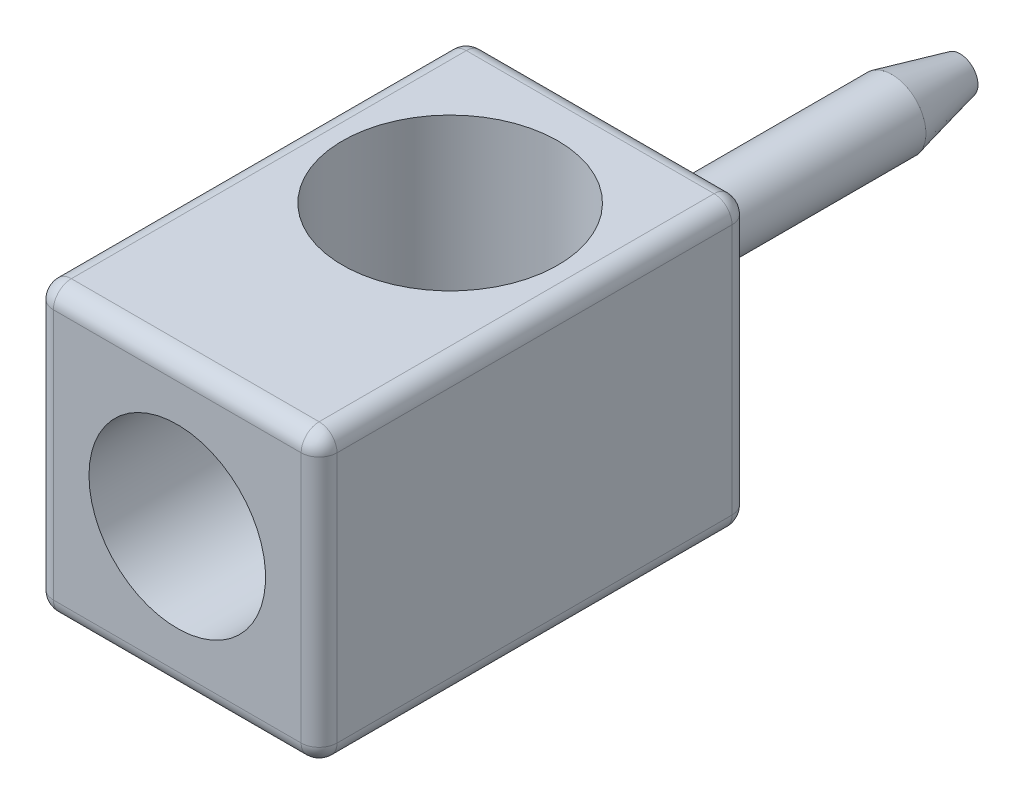
ISO-10303-21;
HEADER;
FILE_DESCRIPTION(('STEP AP214'),'2;1');
FILE_NAME('part.step','',(''),(''),'','','');
FILE_SCHEMA(('AUTOMOTIVE_DESIGN { 1 0 10303 214 1 1 1 1 }'));
ENDSEC;
DATA;
#1=APPLICATION_CONTEXT('core data for automotive mechanical design processes');
#2=APPLICATION_PROTOCOL_DEFINITION('international standard','automotive_design',2000,#1);
#3=PRODUCT_CONTEXT('',#1,'mechanical');
#4=PRODUCT('Part','Part','',(#3));
#5=PRODUCT_RELATED_PRODUCT_CATEGORY('part','',(#4));
#6=PRODUCT_DEFINITION_FORMATION('','',#4);
#7=PRODUCT_DEFINITION_CONTEXT('part definition',#1,'design');
#8=PRODUCT_DEFINITION('design','',#6,#7);
#9=PRODUCT_DEFINITION_SHAPE('','',#8);
#10=(LENGTH_UNIT() NAMED_UNIT(*) SI_UNIT(.MILLI.,.METRE.));
#11=(NAMED_UNIT(*) PLANE_ANGLE_UNIT() SI_UNIT($,.RADIAN.));
#12=(NAMED_UNIT(*) SI_UNIT($,.STERADIAN.) SOLID_ANGLE_UNIT());
#13=UNCERTAINTY_MEASURE_WITH_UNIT(LENGTH_MEASURE(1.E-05),#10,'distance_accuracy_value','');
#14=(GEOMETRIC_REPRESENTATION_CONTEXT(3) GLOBAL_UNCERTAINTY_ASSIGNED_CONTEXT((#13)) GLOBAL_UNIT_ASSIGNED_CONTEXT((#10,
#11,#12)) REPRESENTATION_CONTEXT('',''));
#15=CARTESIAN_POINT('',(0.,0.,0.));
#16=DIRECTION('',(0.,0.,1.));
#17=DIRECTION('',(1.,0.,0.));
#18=AXIS2_PLACEMENT_3D('',#15,#16,#17);
#19=CARTESIAN_POINT('',(0.,0.,-7.9));
#20=DIRECTION('',(0.,0.,1.));
#21=DIRECTION('',(1.,0.,0.));
#22=AXIS2_PLACEMENT_3D('',#19,#20,#21);
#23=PLANE('',#22);
#24=CARTESIAN_POINT('',(0.,0.,-7.90000000000646));
#25=DIRECTION('',(0.,0.,1.));
#26=DIRECTION('',(1.,0.,0.));
#27=AXIS2_PLACEMENT_3D('',#24,#25,#26);
#28=CIRCLE('',#27,0.249999999979877);
#29=CARTESIAN_POINT('',(0.249999999979877,0.,-7.90000000000646));
#30=VERTEX_POINT('',#29);
#31=EDGE_CURVE('E20',#30,#30,#28,.T.);
#32=ORIENTED_EDGE('',*,*,#31,.F.);
#33=EDGE_LOOP('',(#32));
#34=FACE_BOUND('',#33,.T.);
#35=ADVANCED_FACE('F17',(#34),#23,.F.);
#36=CARTESIAN_POINT('',(0.,0.,-6.94999999996071));
#37=DIRECTION('',(0.,0.,1.));
#38=DIRECTION('',(1.,0.,0.));
#39=AXIS2_PLACEMENT_3D('',#36,#37,#38);
#40=CONICAL_SURFACE('',#39,0.474999999994452,0.232556941808636);
#41=CARTESIAN_POINT('',(0.,0.,-6.95));
#42=DIRECTION('',(0.,0.,-1.));
#43=DIRECTION('',(-1.,0.,0.));
#44=AXIS2_PLACEMENT_3D('',#41,#42,#43);
#45=CIRCLE('',#44,0.475);
#46=CARTESIAN_POINT('',(-0.475000000000001,0.,-6.95));
#47=VERTEX_POINT('',#46);
#48=EDGE_CURVE('E217',#47,#47,#45,.F.);
#49=ORIENTED_EDGE('',*,*,#48,.F.);
#50=EDGE_LOOP('',(#49));
#51=FACE_BOUND('',#50,.T.);
#52=ORIENTED_EDGE('',*,*,#31,.T.);
#53=EDGE_LOOP('',(#52));
#54=FACE_BOUND('',#53,.T.);
#55=ADVANCED_FACE('F235',(#51,#54),#40,.T.);
#56=CARTESIAN_POINT('',(0.,0.,-7.9));
#57=DIRECTION('',(0.,0.,-1.));
#58=DIRECTION('',(-1.,0.,0.));
#59=AXIS2_PLACEMENT_3D('',#56,#57,#58);
#60=CYLINDRICAL_SURFACE('',#59,0.475);
#61=CARTESIAN_POINT('',(0.,0.,-3.));
#62=DIRECTION('',(0.,0.,-1.));
#63=DIRECTION('',(-1.,0.,0.));
#64=AXIS2_PLACEMENT_3D('',#61,#62,#63);
#65=CIRCLE('',#64,0.475);
#66=CARTESIAN_POINT('',(-0.475000000000001,0.,-3.));
#67=VERTEX_POINT('',#66);
#68=EDGE_CURVE('E195',#67,#67,#65,.T.);
#69=ORIENTED_EDGE('',*,*,#68,.T.);
#70=EDGE_LOOP('',(#69));
#71=FACE_BOUND('',#70,.T.);
#72=ORIENTED_EDGE('',*,*,#48,.T.);
#73=EDGE_LOOP('',(#72));
#74=FACE_BOUND('',#73,.T.);
#75=ADVANCED_FACE('F232',(#71,#74),#60,.T.);
#76=CARTESIAN_POINT('',(1.725,-2.,-2.75));
#77=DIRECTION('',(0.,-1.,0.));
#78=DIRECTION('',(0.,0.,-1.));
#79=AXIS2_PLACEMENT_3D('',#76,#77,#78);
#80=CYLINDRICAL_SURFACE('',#79,0.25);
#81=CARTESIAN_POINT('',(1.725,1.75,-2.75));
#82=DIRECTION('',(0.,1.,-6.13305568504924E-12));
#83=DIRECTION('',(1.,0.,0.));
#84=AXIS2_PLACEMENT_3D('',#81,#82,#83);
#85=CIRCLE('',#84,0.25);
#86=CARTESIAN_POINT('',(1.975,1.75,-2.75));
#87=VERTEX_POINT('',#86);
#88=CARTESIAN_POINT('',(1.725,1.74999999999962,-3.));
#89=VERTEX_POINT('',#88);
#90=EDGE_CURVE('E216',#87,#89,#85,.T.);
#91=ORIENTED_EDGE('',*,*,#90,.F.);
#92=DIRECTION('',(0.,1.,0.));
#93=VECTOR('',#92,1.);
#94=CARTESIAN_POINT('',(1.975,-2.,-2.75));
#95=LINE('',#94,#93);
#96=CARTESIAN_POINT('',(1.975,-1.75,-2.75));
#97=VERTEX_POINT('',#96);
#98=EDGE_CURVE('E105',#87,#97,#95,.F.);
#99=ORIENTED_EDGE('',*,*,#98,.T.);
#100=CARTESIAN_POINT('',(1.725,-1.75,-2.75));
#101=DIRECTION('',(0.,1.,0.));
#102=DIRECTION('',(1.,0.,0.));
#103=AXIS2_PLACEMENT_3D('',#100,#101,#102);
#104=CIRCLE('',#103,0.25);
#105=CARTESIAN_POINT('',(1.725,-1.75,-3.));
#106=VERTEX_POINT('',#105);
#107=EDGE_CURVE('E193',#106,#97,#104,.F.);
#108=ORIENTED_EDGE('',*,*,#107,.F.);
#109=DIRECTION('',(0.,1.,0.));
#110=VECTOR('',#109,1.);
#111=CARTESIAN_POINT('',(1.725,-2.,-3.));
#112=LINE('',#111,#110);
#113=EDGE_CURVE('E192',#106,#89,#112,.T.);
#114=ORIENTED_EDGE('',*,*,#113,.T.);
#115=EDGE_LOOP('',(#91,#99,#108,#114));
#116=FACE_BOUND('',#115,.T.);
#117=ADVANCED_FACE('F228',(#116),#80,.T.);
#118=CARTESIAN_POINT('',(-1.725,2.,-2.75));
#119=DIRECTION('',(0.,1.,0.));
#120=DIRECTION('',(0.,0.,1.));
#121=AXIS2_PLACEMENT_3D('',#118,#119,#120);
#122=CYLINDRICAL_SURFACE('',#121,0.25);
#123=CARTESIAN_POINT('',(-1.725,1.75,-2.75));
#124=DIRECTION('',(0.,1.,0.));
#125=DIRECTION('',(1.,0.,0.));
#126=AXIS2_PLACEMENT_3D('',#123,#124,#125);
#127=CIRCLE('',#126,0.25);
#128=CARTESIAN_POINT('',(-1.725,1.75,-3.));
#129=VERTEX_POINT('',#128);
#130=CARTESIAN_POINT('',(-1.975,1.75,-2.75));
#131=VERTEX_POINT('',#130);
#132=EDGE_CURVE('E123',#129,#131,#127,.T.);
#133=ORIENTED_EDGE('',*,*,#132,.F.);
#134=DIRECTION('',(0.,1.,0.));
#135=VECTOR('',#134,1.);
#136=CARTESIAN_POINT('',(-1.725,-2.,-3.));
#137=LINE('',#136,#135);
#138=CARTESIAN_POINT('',(-1.725,-1.75000000000038,-3.));
#139=VERTEX_POINT('',#138);
#140=EDGE_CURVE('E422',#129,#139,#137,.F.);
#141=ORIENTED_EDGE('',*,*,#140,.T.);
#142=CARTESIAN_POINT('',(-1.725,-1.75,-2.75));
#143=DIRECTION('',(0.,1.,-6.13305568504924E-12));
#144=DIRECTION('',(1.,0.,0.));
#145=AXIS2_PLACEMENT_3D('',#142,#143,#144);
#146=CIRCLE('',#145,0.25);
#147=CARTESIAN_POINT('',(-1.975,-1.75,-2.75));
#148=VERTEX_POINT('',#147);
#149=EDGE_CURVE('E171',#148,#139,#146,.F.);
#150=ORIENTED_EDGE('',*,*,#149,.F.);
#151=DIRECTION('',(0.,1.,0.));
#152=VECTOR('',#151,1.);
#153=CARTESIAN_POINT('',(-1.975,2.,-2.75));
#154=LINE('',#153,#152);
#155=EDGE_CURVE('E168',#148,#131,#154,.T.);
#156=ORIENTED_EDGE('',*,*,#155,.T.);
#157=EDGE_LOOP('',(#133,#141,#150,#156));
#158=FACE_BOUND('',#157,.T.);
#159=ADVANCED_FACE('F225',(#158),#122,.T.);
#160=CARTESIAN_POINT('',(1.725,1.75,2.75));
#161=DIRECTION('',(1.,0.,0.));
#162=DIRECTION('',(0.,1.,0.));
#163=AXIS2_PLACEMENT_3D('',#160,#161,#162);
#164=SPHERICAL_SURFACE('',#163,0.25);
#165=CARTESIAN_POINT('',(1.725,1.75,2.75));
#166=DIRECTION('',(0.,0.,1.));
#167=DIRECTION('',(1.,0.,0.));
#168=AXIS2_PLACEMENT_3D('',#165,#166,#167);
#169=CIRCLE('',#168,0.25);
#170=CARTESIAN_POINT('',(1.725,2.,2.75));
#171=VERTEX_POINT('',#170);
#172=CARTESIAN_POINT('',(1.975,1.75,2.75));
#173=VERTEX_POINT('',#172);
#174=EDGE_CURVE('E114',#171,#173,#169,.F.);
#175=ORIENTED_EDGE('',*,*,#174,.F.);
#176=CARTESIAN_POINT('',(1.725,1.75,2.75));
#177=DIRECTION('',(-1.,0.,0.));
#178=DIRECTION('',(0.,0.,1.));
#179=AXIS2_PLACEMENT_3D('',#176,#177,#178);
#180=CIRCLE('',#179,0.25);
#181=CARTESIAN_POINT('',(1.725,1.75,3.));
#182=VERTEX_POINT('',#181);
#183=EDGE_CURVE('E116',#182,#171,#180,.T.);
#184=ORIENTED_EDGE('',*,*,#183,.F.);
#185=CARTESIAN_POINT('',(1.725,1.75,2.75));
#186=DIRECTION('',(0.,1.,0.));
#187=DIRECTION('',(0.,0.,1.));
#188=AXIS2_PLACEMENT_3D('',#185,#186,#187);
#189=CIRCLE('',#188,0.25);
#190=EDGE_CURVE('E111',#173,#182,#189,.F.);
#191=ORIENTED_EDGE('',*,*,#190,.F.);
#192=EDGE_LOOP('',(#175,#184,#191));
#193=FACE_BOUND('',#192,.T.);
#194=ADVANCED_FACE('F113',(#193),#164,.T.);
#195=CARTESIAN_POINT('',(-1.725,1.75,2.75));
#196=DIRECTION('',(1.,0.,0.));
#197=DIRECTION('',(0.,1.,0.));
#198=AXIS2_PLACEMENT_3D('',#195,#196,#197);
#199=SPHERICAL_SURFACE('',#198,0.25);
#200=CARTESIAN_POINT('',(-1.725,1.75,2.75));
#201=DIRECTION('',(-1.,0.,0.));
#202=DIRECTION('',(0.,0.,1.));
#203=AXIS2_PLACEMENT_3D('',#200,#201,#202);
#204=CIRCLE('',#203,0.25);
#205=CARTESIAN_POINT('',(-1.725,2.,2.75));
#206=VERTEX_POINT('',#205);
#207=CARTESIAN_POINT('',(-1.725,1.75000000000077,3.));
#208=VERTEX_POINT('',#207);
#209=EDGE_CURVE('E313',#206,#208,#204,.F.);
#210=ORIENTED_EDGE('',*,*,#209,.F.);
#211=CARTESIAN_POINT('',(-1.725,1.75,2.75));
#212=DIRECTION('',(0.,0.,1.));
#213=DIRECTION('',(1.,0.,0.));
#214=AXIS2_PLACEMENT_3D('',#211,#212,#213);
#215=CIRCLE('',#214,0.25);
#216=CARTESIAN_POINT('',(-1.975,1.75,2.75));
#217=VERTEX_POINT('',#216);
#218=EDGE_CURVE('E321',#217,#206,#215,.F.);
#219=ORIENTED_EDGE('',*,*,#218,.F.);
#220=CARTESIAN_POINT('',(-1.725,1.75,2.75));
#221=DIRECTION('',(0.,-1.,0.));
#222=DIRECTION('',(0.,0.,-1.));
#223=AXIS2_PLACEMENT_3D('',#220,#221,#222);
#224=CIRCLE('',#223,0.25);
#225=EDGE_CURVE('E122',#208,#217,#224,.T.);
#226=ORIENTED_EDGE('',*,*,#225,.F.);
#227=EDGE_LOOP('',(#210,#219,#226));
#228=FACE_BOUND('',#227,.T.);
#229=ADVANCED_FACE('F210',(#228),#199,.T.);
#230=CARTESIAN_POINT('',(1.725,1.75,-2.75));
#231=DIRECTION('',(1.,0.,0.));
#232=DIRECTION('',(0.,1.,0.));
#233=AXIS2_PLACEMENT_3D('',#230,#231,#232);
#234=SPHERICAL_SURFACE('',#233,0.25);
#235=ORIENTED_EDGE('',*,*,#90,.T.);
#236=CARTESIAN_POINT('',(1.725,1.75,-2.75));
#237=DIRECTION('',(1.,0.,0.));
#238=DIRECTION('',(0.,0.,-1.));
#239=AXIS2_PLACEMENT_3D('',#236,#237,#238);
#240=CIRCLE('',#239,0.25);
#241=CARTESIAN_POINT('',(1.725,2.,-2.75));
#242=VERTEX_POINT('',#241);
#243=EDGE_CURVE('E345',#242,#89,#240,.F.);
#244=ORIENTED_EDGE('',*,*,#243,.F.);
#245=CARTESIAN_POINT('',(1.725,1.75,-2.75));
#246=DIRECTION('',(0.,0.,1.));
#247=DIRECTION('',(1.,0.,0.));
#248=AXIS2_PLACEMENT_3D('',#245,#246,#247);
#249=CIRCLE('',#248,0.25);
#250=EDGE_CURVE('E141',#87,#242,#249,.T.);
#251=ORIENTED_EDGE('',*,*,#250,.F.);
#252=EDGE_LOOP('',(#235,#244,#251));
#253=FACE_BOUND('',#252,.T.);
#254=ADVANCED_FACE('F206',(#253),#234,.T.);
#255=CARTESIAN_POINT('',(-1.725,1.75,-2.75));
#256=DIRECTION('',(1.,0.,0.));
#257=DIRECTION('',(0.,1.,0.));
#258=AXIS2_PLACEMENT_3D('',#255,#256,#257);
#259=SPHERICAL_SURFACE('',#258,0.25);
#260=ORIENTED_EDGE('',*,*,#132,.T.);
#261=CARTESIAN_POINT('',(-1.725,1.75,-2.75));
#262=DIRECTION('',(0.,0.,1.));
#263=DIRECTION('',(1.,0.,0.));
#264=AXIS2_PLACEMENT_3D('',#261,#262,#263);
#265=CIRCLE('',#264,0.25);
#266=CARTESIAN_POINT('',(-1.725,2.,-2.75));
#267=VERTEX_POINT('',#266);
#268=EDGE_CURVE('E351',#267,#131,#265,.T.);
#269=ORIENTED_EDGE('',*,*,#268,.F.);
#270=CARTESIAN_POINT('',(-1.725,1.75,-2.75));
#271=DIRECTION('',(1.,0.,0.));
#272=DIRECTION('',(0.,0.,-1.));
#273=AXIS2_PLACEMENT_3D('',#270,#271,#272);
#274=CIRCLE('',#273,0.25);
#275=EDGE_CURVE('E340',#129,#267,#274,.T.);
#276=ORIENTED_EDGE('',*,*,#275,.F.);
#277=EDGE_LOOP('',(#260,#269,#276));
#278=FACE_BOUND('',#277,.T.);
#279=ADVANCED_FACE('F202',(#278),#259,.T.);
#280=CARTESIAN_POINT('',(1.725,-2.,2.75));
#281=DIRECTION('',(0.,1.,0.));
#282=DIRECTION('',(0.,0.,1.));
#283=AXIS2_PLACEMENT_3D('',#280,#281,#282);
#284=CYLINDRICAL_SURFACE('',#283,0.25);
#285=ORIENTED_EDGE('',*,*,#190,.T.);
#286=DIRECTION('',(0.,1.,0.));
#287=VECTOR('',#286,1.);
#288=CARTESIAN_POINT('',(1.725,-2.,3.));
#289=LINE('',#288,#287);
#290=CARTESIAN_POINT('',(1.725,-1.74999999999962,3.));
#291=VERTEX_POINT('',#290);
#292=EDGE_CURVE('E327',#291,#182,#289,.T.);
#293=ORIENTED_EDGE('',*,*,#292,.F.);
#294=CARTESIAN_POINT('',(1.725,-1.75,2.75));
#295=DIRECTION('',(0.,-1.,6.13293322036932E-12));
#296=DIRECTION('',(1.,0.,0.));
#297=AXIS2_PLACEMENT_3D('',#294,#295,#296);
#298=CIRCLE('',#297,0.25);
#299=CARTESIAN_POINT('',(1.975,-1.75,2.75));
#300=VERTEX_POINT('',#299);
#301=EDGE_CURVE('E137',#300,#291,#298,.T.);
#302=ORIENTED_EDGE('',*,*,#301,.F.);
#303=DIRECTION('',(0.,1.,0.));
#304=VECTOR('',#303,1.);
#305=CARTESIAN_POINT('',(1.975,-2.,2.75));
#306=LINE('',#305,#304);
#307=EDGE_CURVE('E135',#300,#173,#306,.T.);
#308=ORIENTED_EDGE('',*,*,#307,.T.);
#309=EDGE_LOOP('',(#285,#293,#302,#308));
#310=FACE_BOUND('',#309,.T.);
#311=ADVANCED_FACE('F136',(#310),#284,.T.);
#312=CARTESIAN_POINT('',(-1.725,-2.,2.75));
#313=DIRECTION('',(0.,-1.,0.));
#314=DIRECTION('',(0.,0.,-1.));
#315=AXIS2_PLACEMENT_3D('',#312,#313,#314);
#316=CYLINDRICAL_SURFACE('',#315,0.25);
#317=ORIENTED_EDGE('',*,*,#225,.T.);
#318=DIRECTION('',(0.,1.,0.));
#319=VECTOR('',#318,1.);
#320=CARTESIAN_POINT('',(-1.975,2.,2.75));
#321=LINE('',#320,#319);
#322=CARTESIAN_POINT('',(-1.975,-1.75,2.75));
#323=VERTEX_POINT('',#322);
#324=EDGE_CURVE('E165',#217,#323,#321,.F.);
#325=ORIENTED_EDGE('',*,*,#324,.T.);
#326=CARTESIAN_POINT('',(-1.725,-1.75,2.75));
#327=DIRECTION('',(0.,-1.,0.));
#328=DIRECTION('',(1.,0.,0.));
#329=AXIS2_PLACEMENT_3D('',#326,#327,#328);
#330=CIRCLE('',#329,0.25);
#331=CARTESIAN_POINT('',(-1.725,-1.75,3.));
#332=VERTEX_POINT('',#331);
#333=EDGE_CURVE('E132',#332,#323,#330,.T.);
#334=ORIENTED_EDGE('',*,*,#333,.F.);
#335=DIRECTION('',(0.,1.,0.));
#336=VECTOR('',#335,1.);
#337=CARTESIAN_POINT('',(-1.725,-2.,3.));
#338=LINE('',#337,#336);
#339=EDGE_CURVE('E326',#208,#332,#338,.F.);
#340=ORIENTED_EDGE('',*,*,#339,.F.);
#341=EDGE_LOOP('',(#317,#325,#334,#340));
#342=FACE_BOUND('',#341,.T.);
#343=ADVANCED_FACE('F332',(#342),#316,.T.);
#344=CARTESIAN_POINT('',(1.975,-2.,3.));
#345=DIRECTION('',(-1.,0.,0.));
#346=DIRECTION('',(0.,0.,1.));
#347=AXIS2_PLACEMENT_3D('',#344,#345,#346);
#348=PLANE('',#347);
#349=DIRECTION('',(0.,0.,1.));
#350=VECTOR('',#349,1.);
#351=CARTESIAN_POINT('',(1.975,1.75,3.));
#352=LINE('',#351,#350);
#353=EDGE_CURVE('E128',#173,#87,#352,.F.);
#354=ORIENTED_EDGE('',*,*,#353,.F.);
#355=ORIENTED_EDGE('',*,*,#307,.F.);
#356=DIRECTION('',(0.,0.,1.));
#357=VECTOR('',#356,1.);
#358=CARTESIAN_POINT('',(1.975,-1.75,3.));
#359=LINE('',#358,#357);
#360=EDGE_CURVE('E384',#97,#300,#359,.T.);
#361=ORIENTED_EDGE('',*,*,#360,.F.);
#362=ORIENTED_EDGE('',*,*,#98,.F.);
#363=EDGE_LOOP('',(#354,#355,#361,#362));
#364=FACE_BOUND('',#363,.T.);
#365=ADVANCED_FACE('F140',(#364),#348,.F.);
#366=CARTESIAN_POINT('',(1.725,-1.75,-2.75));
#367=DIRECTION('',(1.,0.,0.));
#368=DIRECTION('',(0.,1.,0.));
#369=AXIS2_PLACEMENT_3D('',#366,#367,#368);
#370=SPHERICAL_SURFACE('',#369,0.25);
#371=CARTESIAN_POINT('',(1.725,-1.75,-2.75));
#372=DIRECTION('',(0.,0.,1.));
#373=DIRECTION('',(1.,0.,0.));
#374=AXIS2_PLACEMENT_3D('',#371,#372,#373);
#375=CIRCLE('',#374,0.25);
#376=CARTESIAN_POINT('',(1.725,-2.,-2.74999999999847));
#377=VERTEX_POINT('',#376);
#378=EDGE_CURVE('E335',#377,#97,#375,.T.);
#379=ORIENTED_EDGE('',*,*,#378,.F.);
#380=CARTESIAN_POINT('',(1.725,-1.75,-2.75));
#381=DIRECTION('',(-1.,0.,0.));
#382=DIRECTION('',(0.,0.,1.));
#383=AXIS2_PLACEMENT_3D('',#380,#381,#382);
#384=CIRCLE('',#383,0.25);
#385=EDGE_CURVE('E382',#106,#377,#384,.T.);
#386=ORIENTED_EDGE('',*,*,#385,.F.);
#387=ORIENTED_EDGE('',*,*,#107,.T.);
#388=EDGE_LOOP('',(#379,#386,#387));
#389=FACE_BOUND('',#388,.T.);
#390=ADVANCED_FACE('F182',(#389),#370,.T.);
#391=CARTESIAN_POINT('',(-1.975,-2.,-3.));
#392=DIRECTION('',(0.,0.,1.));
#393=DIRECTION('',(1.,0.,0.));
#394=AXIS2_PLACEMENT_3D('',#391,#392,#393);
#395=PLANE('',#394);
#396=DIRECTION('',(1.,0.,0.));
#397=VECTOR('',#396,1.);
#398=CARTESIAN_POINT('',(1.975,1.75,-3.));
#399=LINE('',#398,#397);
#400=EDGE_CURVE('E342',#89,#129,#399,.F.);
#401=ORIENTED_EDGE('',*,*,#400,.F.);
#402=ORIENTED_EDGE('',*,*,#113,.F.);
#403=DIRECTION('',(-1.,0.,0.));
#404=VECTOR('',#403,1.);
#405=CARTESIAN_POINT('',(-1.975,-1.75,-3.));
#406=LINE('',#405,#404);
#407=EDGE_CURVE('E376',#139,#106,#406,.F.);
#408=ORIENTED_EDGE('',*,*,#407,.F.);
#409=ORIENTED_EDGE('',*,*,#140,.F.);
#410=EDGE_LOOP('',(#401,#402,#408,#409));
#411=FACE_BOUND('',#410,.T.);
#412=ORIENTED_EDGE('',*,*,#68,.F.);
#413=EDGE_LOOP('',(#412));
#414=FACE_BOUND('',#413,.T.);
#415=ADVANCED_FACE('F178',(#411,#414),#395,.F.);
#416=CARTESIAN_POINT('',(-1.725,-1.75,-2.75));
#417=DIRECTION('',(1.,0.,0.));
#418=DIRECTION('',(0.,1.,0.));
#419=AXIS2_PLACEMENT_3D('',#416,#417,#418);
#420=SPHERICAL_SURFACE('',#419,0.25);
#421=CARTESIAN_POINT('',(-1.725,-1.75,-2.75));
#422=DIRECTION('',(0.,0.,1.));
#423=DIRECTION('',(1.,0.,0.));
#424=AXIS2_PLACEMENT_3D('',#421,#422,#423);
#425=CIRCLE('',#424,0.25);
#426=CARTESIAN_POINT('',(-1.725,-2.,-2.75));
#427=VERTEX_POINT('',#426);
#428=EDGE_CURVE('E371',#148,#427,#425,.T.);
#429=ORIENTED_EDGE('',*,*,#428,.F.);
#430=ORIENTED_EDGE('',*,*,#149,.T.);
#431=CARTESIAN_POINT('',(-1.725,-1.75,-2.75));
#432=DIRECTION('',(-1.,0.,0.));
#433=DIRECTION('',(0.,0.,1.));
#434=AXIS2_PLACEMENT_3D('',#431,#432,#433);
#435=CIRCLE('',#434,0.25);
#436=EDGE_CURVE('E379',#427,#139,#435,.F.);
#437=ORIENTED_EDGE('',*,*,#436,.F.);
#438=EDGE_LOOP('',(#429,#430,#437));
#439=FACE_BOUND('',#438,.T.);
#440=ADVANCED_FACE('F175',(#439),#420,.T.);
#441=CARTESIAN_POINT('',(-1.975,2.,3.));
#442=DIRECTION('',(1.,0.,0.));
#443=DIRECTION('',(0.,0.,-1.));
#444=AXIS2_PLACEMENT_3D('',#441,#442,#443);
#445=PLANE('',#444);
#446=DIRECTION('',(0.,0.,1.));
#447=VECTOR('',#446,1.);
#448=CARTESIAN_POINT('',(-1.975,1.75,3.));
#449=LINE('',#448,#447);
#450=EDGE_CURVE('E348',#131,#217,#449,.T.);
#451=ORIENTED_EDGE('',*,*,#450,.F.);
#452=ORIENTED_EDGE('',*,*,#155,.F.);
#453=DIRECTION('',(0.,0.,1.));
#454=VECTOR('',#453,1.);
#455=CARTESIAN_POINT('',(-1.975,-1.75,3.));
#456=LINE('',#455,#454);
#457=EDGE_CURVE('E362',#323,#148,#456,.F.);
#458=ORIENTED_EDGE('',*,*,#457,.F.);
#459=ORIENTED_EDGE('',*,*,#324,.F.);
#460=EDGE_LOOP('',(#451,#452,#458,#459));
#461=FACE_BOUND('',#460,.T.);
#462=ADVANCED_FACE('F159',(#461),#445,.F.);
#463=CARTESIAN_POINT('',(1.725,-1.75,2.75));
#464=DIRECTION('',(1.,0.,0.));
#465=DIRECTION('',(0.,1.,0.));
#466=AXIS2_PLACEMENT_3D('',#463,#464,#465);
#467=SPHERICAL_SURFACE('',#466,0.25);
#468=CARTESIAN_POINT('',(1.725,-1.75,2.75));
#469=DIRECTION('',(0.,0.,1.));
#470=DIRECTION('',(1.,0.,0.));
#471=AXIS2_PLACEMENT_3D('',#468,#469,#470);
#472=CIRCLE('',#471,0.25);
#473=CARTESIAN_POINT('',(1.725,-2.,2.75));
#474=VERTEX_POINT('',#473);
#475=EDGE_CURVE('E333',#300,#474,#472,.F.);
#476=ORIENTED_EDGE('',*,*,#475,.F.);
#477=ORIENTED_EDGE('',*,*,#301,.T.);
#478=CARTESIAN_POINT('',(1.725,-1.75,2.75));
#479=DIRECTION('',(1.,0.,0.));
#480=DIRECTION('',(0.,0.,-1.));
#481=AXIS2_PLACEMENT_3D('',#478,#479,#480);
#482=CIRCLE('',#481,0.25);
#483=EDGE_CURVE('E365',#474,#291,#482,.F.);
#484=ORIENTED_EDGE('',*,*,#483,.F.);
#485=EDGE_LOOP('',(#476,#477,#484));
#486=FACE_BOUND('',#485,.T.);
#487=ADVANCED_FACE('F154',(#486),#467,.T.);
#488=CARTESIAN_POINT('',(-1.725,-1.75,2.75));
#489=DIRECTION('',(1.,0.,0.));
#490=DIRECTION('',(0.,1.,0.));
#491=AXIS2_PLACEMENT_3D('',#488,#489,#490);
#492=SPHERICAL_SURFACE('',#491,0.25);
#493=CARTESIAN_POINT('',(-1.725,-1.75,2.75));
#494=DIRECTION('',(1.,0.,0.));
#495=DIRECTION('',(0.,0.,-1.));
#496=AXIS2_PLACEMENT_3D('',#493,#494,#495);
#497=CIRCLE('',#496,0.25);
#498=CARTESIAN_POINT('',(-1.725,-2.,2.74999999999847));
#499=VERTEX_POINT('',#498);
#500=EDGE_CURVE('E35',#332,#499,#497,.T.);
#501=ORIENTED_EDGE('',*,*,#500,.F.);
#502=ORIENTED_EDGE('',*,*,#333,.T.);
#503=CARTESIAN_POINT('',(-1.725,-1.75,2.75));
#504=DIRECTION('',(0.,0.,1.));
#505=DIRECTION('',(1.,0.,0.));
#506=AXIS2_PLACEMENT_3D('',#503,#504,#505);
#507=CIRCLE('',#506,0.25);
#508=EDGE_CURVE('E366',#499,#323,#507,.F.);
#509=ORIENTED_EDGE('',*,*,#508,.F.);
#510=EDGE_LOOP('',(#501,#502,#509));
#511=FACE_BOUND('',#510,.T.);
#512=ADVANCED_FACE('F150',(#511),#492,.T.);
#513=CARTESIAN_POINT('',(1.725,1.75,3.));
#514=DIRECTION('',(0.,0.,1.));
#515=DIRECTION('',(1.,0.,0.));
#516=AXIS2_PLACEMENT_3D('',#513,#514,#515);
#517=CYLINDRICAL_SURFACE('',#516,0.25);
#518=ORIENTED_EDGE('',*,*,#250,.T.);
#519=DIRECTION('',(0.,0.,-1.));
#520=VECTOR('',#519,1.);
#521=CARTESIAN_POINT('',(1.725,2.,3.));
#522=LINE('',#521,#520);
#523=EDGE_CURVE('E131',#242,#171,#522,.F.);
#524=ORIENTED_EDGE('',*,*,#523,.T.);
#525=ORIENTED_EDGE('',*,*,#174,.T.);
#526=ORIENTED_EDGE('',*,*,#353,.T.);
#527=EDGE_LOOP('',(#518,#524,#525,#526));
#528=FACE_BOUND('',#527,.T.);
#529=ADVANCED_FACE('F127',(#528),#517,.T.);
#530=CARTESIAN_POINT('',(-1.975,1.75,2.75));
#531=DIRECTION('',(-1.,0.,0.));
#532=DIRECTION('',(0.,0.,1.));
#533=AXIS2_PLACEMENT_3D('',#530,#531,#532);
#534=CYLINDRICAL_SURFACE('',#533,0.25);
#535=ORIENTED_EDGE('',*,*,#209,.T.);
#536=DIRECTION('',(1.,0.,0.));
#537=VECTOR('',#536,1.);
#538=CARTESIAN_POINT('',(-1.975,1.75,3.));
#539=LINE('',#538,#537);
#540=EDGE_CURVE('E315',#182,#208,#539,.F.);
#541=ORIENTED_EDGE('',*,*,#540,.F.);
#542=ORIENTED_EDGE('',*,*,#183,.T.);
#543=DIRECTION('',(1.,0.,0.));
#544=VECTOR('',#543,1.);
#545=CARTESIAN_POINT('',(1.975,2.,2.75));
#546=LINE('',#545,#544);
#547=EDGE_CURVE('E316',#171,#206,#546,.F.);
#548=ORIENTED_EDGE('',*,*,#547,.T.);
#549=EDGE_LOOP('',(#535,#541,#542,#548));
#550=FACE_BOUND('',#549,.T.);
#551=ADVANCED_FACE('F304',(#550),#534,.T.);
#552=CARTESIAN_POINT('',(-1.725,1.75,3.));
#553=DIRECTION('',(0.,0.,1.));
#554=DIRECTION('',(1.,0.,0.));
#555=AXIS2_PLACEMENT_3D('',#552,#553,#554);
#556=CYLINDRICAL_SURFACE('',#555,0.25);
#557=ORIENTED_EDGE('',*,*,#268,.T.);
#558=ORIENTED_EDGE('',*,*,#450,.T.);
#559=ORIENTED_EDGE('',*,*,#218,.T.);
#560=DIRECTION('',(0.,0.,-1.));
#561=VECTOR('',#560,1.);
#562=CARTESIAN_POINT('',(-1.725,2.,3.));
#563=LINE('',#562,#561);
#564=EDGE_CURVE('E355',#206,#267,#563,.T.);
#565=ORIENTED_EDGE('',*,*,#564,.T.);
#566=EDGE_LOOP('',(#557,#558,#559,#565));
#567=FACE_BOUND('',#566,.T.);
#568=ADVANCED_FACE('F301',(#567),#556,.T.);
#569=CARTESIAN_POINT('',(1.975,1.75,-2.75));
#570=DIRECTION('',(1.,0.,0.));
#571=DIRECTION('',(0.,0.,-1.));
#572=AXIS2_PLACEMENT_3D('',#569,#570,#571);
#573=CYLINDRICAL_SURFACE('',#572,0.25);
#574=ORIENTED_EDGE('',*,*,#275,.T.);
#575=DIRECTION('',(1.,0.,0.));
#576=VECTOR('',#575,1.);
#577=CARTESIAN_POINT('',(1.975,2.,-2.75));
#578=LINE('',#577,#576);
#579=EDGE_CURVE('E401',#267,#242,#578,.T.);
#580=ORIENTED_EDGE('',*,*,#579,.T.);
#581=ORIENTED_EDGE('',*,*,#243,.T.);
#582=ORIENTED_EDGE('',*,*,#400,.T.);
#583=EDGE_LOOP('',(#574,#580,#581,#582));
#584=FACE_BOUND('',#583,.T.);
#585=ADVANCED_FACE('F297',(#584),#573,.T.);
#586=CARTESIAN_POINT('',(-1.975,-2.,3.));
#587=DIRECTION('',(0.,0.,1.));
#588=DIRECTION('',(1.,0.,0.));
#589=AXIS2_PLACEMENT_3D('',#586,#587,#588);
#590=PLANE('',#589);
#591=CARTESIAN_POINT('',(0.,0.,3.));
#592=DIRECTION('',(0.,0.,-1.));
#593=DIRECTION('',(-1.,0.,0.));
#594=AXIS2_PLACEMENT_3D('',#591,#592,#593);
#595=CIRCLE('',#594,1.2295);
#596=CARTESIAN_POINT('',(-1.2295,0.,3.));
#597=VERTEX_POINT('',#596);
#598=EDGE_CURVE('E270',#597,#597,#595,.T.);
#599=ORIENTED_EDGE('',*,*,#598,.T.);
#600=EDGE_LOOP('',(#599));
#601=FACE_BOUND('',#600,.T.);
#602=ORIENTED_EDGE('',*,*,#339,.T.);
#603=DIRECTION('',(1.,0.,0.));
#604=VECTOR('',#603,1.);
#605=CARTESIAN_POINT('',(-1.975,-1.75,3.));
#606=LINE('',#605,#604);
#607=EDGE_CURVE('E369',#291,#332,#606,.F.);
#608=ORIENTED_EDGE('',*,*,#607,.F.);
#609=ORIENTED_EDGE('',*,*,#292,.T.);
#610=ORIENTED_EDGE('',*,*,#540,.T.);
#611=EDGE_LOOP('',(#602,#608,#609,#610));
#612=FACE_BOUND('',#611,.T.);
#613=ADVANCED_FACE('F293',(#601,#612),#590,.T.);
#614=CARTESIAN_POINT('',(1.725,-1.75,3.));
#615=DIRECTION('',(0.,0.,1.));
#616=DIRECTION('',(1.,0.,0.));
#617=AXIS2_PLACEMENT_3D('',#614,#615,#616);
#618=CYLINDRICAL_SURFACE('',#617,0.25);
#619=ORIENTED_EDGE('',*,*,#378,.T.);
#620=ORIENTED_EDGE('',*,*,#360,.T.);
#621=ORIENTED_EDGE('',*,*,#475,.T.);
#622=DIRECTION('',(0.,0.,1.));
#623=VECTOR('',#622,1.);
#624=CARTESIAN_POINT('',(1.725,-2.,3.));
#625=LINE('',#624,#623);
#626=EDGE_CURVE('E390',#474,#377,#625,.F.);
#627=ORIENTED_EDGE('',*,*,#626,.T.);
#628=EDGE_LOOP('',(#619,#620,#621,#627));
#629=FACE_BOUND('',#628,.T.);
#630=ADVANCED_FACE('F289',(#629),#618,.T.);
#631=CARTESIAN_POINT('',(-1.975,-1.75,-2.75));
#632=DIRECTION('',(-1.,0.,0.));
#633=DIRECTION('',(0.,0.,1.));
#634=AXIS2_PLACEMENT_3D('',#631,#632,#633);
#635=CYLINDRICAL_SURFACE('',#634,0.25);
#636=ORIENTED_EDGE('',*,*,#436,.T.);
#637=ORIENTED_EDGE('',*,*,#407,.T.);
#638=ORIENTED_EDGE('',*,*,#385,.T.);
#639=DIRECTION('',(1.,0.,0.));
#640=VECTOR('',#639,1.);
#641=CARTESIAN_POINT('',(-1.975,-2.,-2.75));
#642=LINE('',#641,#640);
#643=EDGE_CURVE('E412',#377,#427,#642,.F.);
#644=ORIENTED_EDGE('',*,*,#643,.T.);
#645=EDGE_LOOP('',(#636,#637,#638,#644));
#646=FACE_BOUND('',#645,.T.);
#647=ADVANCED_FACE('F285',(#646),#635,.T.);
#648=CARTESIAN_POINT('',(-1.725,-1.75,3.));
#649=DIRECTION('',(0.,0.,1.));
#650=DIRECTION('',(1.,0.,0.));
#651=AXIS2_PLACEMENT_3D('',#648,#649,#650);
#652=CYLINDRICAL_SURFACE('',#651,0.25);
#653=ORIENTED_EDGE('',*,*,#508,.T.);
#654=ORIENTED_EDGE('',*,*,#457,.T.);
#655=ORIENTED_EDGE('',*,*,#428,.T.);
#656=DIRECTION('',(0.,0.,1.));
#657=VECTOR('',#656,1.);
#658=CARTESIAN_POINT('',(-1.725,-2.,3.));
#659=LINE('',#658,#657);
#660=EDGE_CURVE('E414',#427,#499,#659,.T.);
#661=ORIENTED_EDGE('',*,*,#660,.T.);
#662=EDGE_LOOP('',(#653,#654,#655,#661));
#663=FACE_BOUND('',#662,.T.);
#664=ADVANCED_FACE('F282',(#663),#652,.T.);
#665=CARTESIAN_POINT('',(-1.975,-1.75,2.75));
#666=DIRECTION('',(1.,0.,0.));
#667=DIRECTION('',(0.,0.,-1.));
#668=AXIS2_PLACEMENT_3D('',#665,#666,#667);
#669=CYLINDRICAL_SURFACE('',#668,0.25);
#670=ORIENTED_EDGE('',*,*,#500,.T.);
#671=DIRECTION('',(1.,0.,0.));
#672=VECTOR('',#671,1.);
#673=CARTESIAN_POINT('',(-1.975,-2.,2.75));
#674=LINE('',#673,#672);
#675=EDGE_CURVE('E269',#499,#474,#674,.T.);
#676=ORIENTED_EDGE('',*,*,#675,.T.);
#677=ORIENTED_EDGE('',*,*,#483,.T.);
#678=ORIENTED_EDGE('',*,*,#607,.T.);
#679=EDGE_LOOP('',(#670,#676,#677,#678));
#680=FACE_BOUND('',#679,.T.);
#681=ADVANCED_FACE('F278',(#680),#669,.T.);
#682=CARTESIAN_POINT('',(1.975,2.,3.));
#683=DIRECTION('',(0.,-1.,0.));
#684=DIRECTION('',(0.,0.,-1.));
#685=AXIS2_PLACEMENT_3D('',#682,#683,#684);
#686=PLANE('',#685);
#687=CARTESIAN_POINT('',(0.,2.,-0.8));
#688=DIRECTION('',(0.,-1.,0.));
#689=DIRECTION('',(0.,0.,-1.));
#690=AXIS2_PLACEMENT_3D('',#687,#688,#689);
#691=CIRCLE('',#690,1.5);
#692=CARTESIAN_POINT('',(0.,2.,-2.3));
#693=VERTEX_POINT('',#692);
#694=EDGE_CURVE('E26',#693,#693,#691,.T.);
#695=ORIENTED_EDGE('',*,*,#694,.T.);
#696=EDGE_LOOP('',(#695));
#697=FACE_BOUND('',#696,.T.);
#698=ORIENTED_EDGE('',*,*,#564,.F.);
#699=ORIENTED_EDGE('',*,*,#547,.F.);
#700=ORIENTED_EDGE('',*,*,#523,.F.);
#701=ORIENTED_EDGE('',*,*,#579,.F.);
#702=EDGE_LOOP('',(#698,#699,#700,#701));
#703=FACE_BOUND('',#702,.T.);
#704=ADVANCED_FACE('F274',(#697,#703),#686,.F.);
#705=CARTESIAN_POINT('',(0.,0.,-5.222073947612));
#706=DIRECTION('',(0.,0.,-1.));
#707=DIRECTION('',(-1.,0.,0.));
#708=AXIS2_PLACEMENT_3D('',#705,#706,#707);
#709=CYLINDRICAL_SURFACE('',#708,1.2295);
#710=ORIENTED_EDGE('',*,*,#598,.F.);
#711=EDGE_LOOP('',(#710));
#712=FACE_BOUND('',#711,.T.);
#713=CARTESIAN_POINT('',(0.,-1.2295,0.700000000000001));
#714=CARTESIAN_POINT('',(-0.0586756518388442,-1.22949637738776,0.699996468009281));
#715=CARTESIAN_POINT('',(-0.117381728692778,-1.22526872879334,0.696525774406884));
#716=CARTESIAN_POINT('',(-0.232853074980751,-1.20866154977245,0.682960020702962));
#717=CARTESIAN_POINT('',(-0.289616401262622,-1.19627409486522,0.672858521058489));
#718=CARTESIAN_POINT('',(-0.399269478939999,-1.16425917746266,0.646976461837367));
#719=CARTESIAN_POINT('',(-0.452180234049151,-1.14467515189846,0.631229987750336));
#720=CARTESIAN_POINT('',(-0.553528429300156,-1.09925690756408,0.59517233466481));
#721=CARTESIAN_POINT('',(-0.601964567633921,-1.07342087775059,0.574859833128107));
#722=CARTESIAN_POINT('',(-0.710433389115819,-1.0061638080457,0.522906913455984));
#723=CARTESIAN_POINT('',(-0.768369527979221,-0.962479734661756,0.489820093316177));
#724=CARTESIAN_POINT('',(-0.87478716838952,-0.866923767880132,0.420167183996039));
#725=CARTESIAN_POINT('',(-0.923241193638941,-0.815028845346737,0.38359142747222));
#726=CARTESIAN_POINT('',(-1.01125053989705,-0.703004293309474,0.309385345519028));
#727=CARTESIAN_POINT('',(-1.05063657612754,-0.642747226853497,0.271747739691993));
#728=CARTESIAN_POINT('',(-1.11896469328525,-0.514625403423443,0.200166957246958));
#729=CARTESIAN_POINT('',(-1.14793938235781,-0.446785287310187,0.166212482561811));
#730=CARTESIAN_POINT('',(-1.18379329157011,-0.334769873643118,0.121449180311196));
#731=CARTESIAN_POINT('',(-1.1947797721879,-0.293370911229479,0.107040183914373));
#732=CARTESIAN_POINT('',(-1.21249816507457,-0.208320190233533,0.0832148069911722));
#733=CARTESIAN_POINT('',(-1.2192406804455,-0.164674343091646,0.073785993566944));
#734=CARTESIAN_POINT('',(-1.22800558565203,-0.0754647319540066,0.061433262773087));
#735=CARTESIAN_POINT('',(-1.22997691597047,-0.0298854873995412,0.0585797270430641));
#736=CARTESIAN_POINT('',(-1.22882518979441,0.0610817518572238,0.060225731260301));
#737=CARTESIAN_POINT('',(-1.22569988702431,0.106469653387303,0.0647285134118089));
#738=CARTESIAN_POINT('',(-1.21404546119859,0.200698900617235,0.0810213079685854));
#739=CARTESIAN_POINT('',(-1.20492663635757,0.249322620503191,0.0936026040182783));
#740=CARTESIAN_POINT('',(-1.18153848876305,0.343522452780752,0.124303937534247));
#741=CARTESIAN_POINT('',(-1.16725289768138,0.389088393970183,0.142441441631623));
#742=CARTESIAN_POINT('',(-1.12506153542458,0.501222105160863,0.192883998877429));
#743=CARTESIAN_POINT('',(-1.09398708408622,0.565542929852665,0.227491775843753));
#744=CARTESIAN_POINT('',(-1.02208980784158,0.687014290295956,0.299059108999354));
#745=CARTESIAN_POINT('',(-0.981250844687582,0.744152714295167,0.336022483418676));
#746=CARTESIAN_POINT('',(-0.888209756332652,0.853284491028315,0.410277345837394));
#747=CARTESIAN_POINT('',(-0.835618246238254,0.904980378442699,0.447522751761422));
#748=CARTESIAN_POINT('',(-0.72025955591567,0.999205898772771,0.517481017384267));
#749=CARTESIAN_POINT('',(-0.6575162065582,1.04175646795873,0.550204167117513));
#750=CARTESIAN_POINT('',(-0.540672011087945,1.10567249868106,0.600201029788128));
#751=CARTESIAN_POINT('',(-0.488770536976442,1.1296588222207,0.619264120758289));
#752=CARTESIAN_POINT('',(-0.380655769525207,1.17051050699051,0.651989603438247));
#753=CARTESIAN_POINT('',(-0.324449657715253,1.18738743581153,0.665660765946441));
#754=CARTESIAN_POINT('',(-0.223455665681357,1.20983903945242,0.683917098404812));
#755=CARTESIAN_POINT('',(-0.179309870528533,1.21718165715779,0.689917108290721));
#756=CARTESIAN_POINT('',(-0.0901154124108864,1.22701371492691,0.697960067383491));
#757=CARTESIAN_POINT('',(-0.0450666803989193,1.22950278240057,0.700002712797228));
#758=CARTESIAN_POINT('',(0.0586756518671389,1.22949637738645,0.699996468008202));
#759=CARTESIAN_POINT('',(0.117381728721539,1.22526872879061,0.696525774404645));
#760=CARTESIAN_POINT('',(0.232853075010076,1.20866154976682,0.682960020698372));
#761=CARTESIAN_POINT('',(0.289616401292046,1.19627409485811,0.67285852105271));
#762=CARTESIAN_POINT('',(0.399269478969307,1.16425917745263,0.646976461829288));
#763=CARTESIAN_POINT('',(0.452180234078248,1.14467515188698,0.631229987741145));
#764=CARTESIAN_POINT('',(0.553528429328607,1.09925690754977,0.595172334653523));
#765=CARTESIAN_POINT('',(0.601964567661937,1.07342087773489,0.574859833115838));
#766=CARTESIAN_POINT('',(0.710433389143156,1.00616380802648,0.522906913441329));
#767=CARTESIAN_POINT('',(0.768369528006166,0.962479734640328,0.489820093300135));
#768=CARTESIAN_POINT('',(0.874787168415332,0.86692376785418,0.420167183977544));
#769=CARTESIAN_POINT('',(0.923241193664006,0.815028845318459,0.383591427452659));
#770=CARTESIAN_POINT('',(1.01125053992023,0.703004293276288,0.309385345497893));
#771=CARTESIAN_POINT('',(1.05063657614956,0.642747226817723,0.271747739670362));
#772=CARTESIAN_POINT('',(1.11896469330437,0.514625403382113,0.200166957225515));
#773=CARTESIAN_POINT('',(1.14793938237519,0.4467852872659,0.166212482541044));
#774=CARTESIAN_POINT('',(1.18379329158334,0.334769873596211,0.121449180294141));
#775=CARTESIAN_POINT('',(1.19477977219924,0.293370911183139,0.107040183899388));
#776=CARTESIAN_POINT('',(1.21249816508224,0.208320190188688,0.0832148069806001));
#777=CARTESIAN_POINT('',(1.21924068045138,0.164674343047726,0.0737859935587127));
#778=CARTESIAN_POINT('',(1.22800558565452,0.0754647319126172,0.06143326276951));
#779=CARTESIAN_POINT('',(1.22997691597137,0.0298854873597657,0.0585797270417814));
#780=CARTESIAN_POINT('',(1.22882518979255,-0.0610817518933233,0.0602257312629577));
#781=CARTESIAN_POINT('',(1.22569988702128,-0.10646965342134,0.0647285134161171));
#782=CARTESIAN_POINT('',(1.21404546119308,-0.200698900651036,0.0810213079762004));
#783=CARTESIAN_POINT('',(1.20492663635031,-0.249322620538615,0.093602604028124));
#784=CARTESIAN_POINT('',(1.181538488752,-0.34352245281901,0.124303937548428));
#785=CARTESIAN_POINT('',(1.16725289766829,-0.389088394009652,0.142441441647909));
#786=CARTESIAN_POINT('',(1.12506153540598,-0.501222105202986,0.192883998898678));
#787=CARTESIAN_POINT('',(1.09398708406398,-0.565542929896059,0.227491775867653));
#788=CARTESIAN_POINT('',(1.02208980781128,-0.687014290341332,0.299059109027739));
#789=CARTESIAN_POINT('',(0.981250844652871,-0.744152714341253,0.336022483448894));
#790=CARTESIAN_POINT('',(0.888209756288649,-0.853284491074344,0.410277345869892));
#791=CARTESIAN_POINT('',(0.835618246189456,-0.904980378488021,0.447522751794343));
#792=CARTESIAN_POINT('',(0.720259555856666,-0.999205898815531,0.517481017416737));
#793=CARTESIAN_POINT('',(0.65751620649379,-1.04175646799964,0.550204167149114));
#794=CARTESIAN_POINT('',(0.540672011017441,-1.10567249871547,0.600201029815335));
#795=CARTESIAN_POINT('',(0.488770536905638,-1.12965882225126,0.619264120782638));
#796=CARTESIAN_POINT('',(0.380655769454596,-1.17051050701339,0.651989603456719));
#797=CARTESIAN_POINT('',(0.324449657645138,-1.18738743583059,0.6656607659619));
#798=CARTESIAN_POINT('',(0.223455665627281,-1.20983903946182,0.683917098412491));
#799=CARTESIAN_POINT('',(0.179309870490339,-1.2171816571628,0.689917108294823));
#800=CARTESIAN_POINT('',(0.0901154124052574,-1.22701371492673,0.69796006738334));
#801=CARTESIAN_POINT('',(0.0450666804099724,-1.22950278239956,0.7000027127964));
#802=CARTESIAN_POINT('',(0.,-1.2295,0.700000000000001));
#803=B_SPLINE_CURVE_WITH_KNOTS('',3,(#713,#714,#715,#716,#717,#718,#719,#720,#721,#722,#723,
#724,#725,#726,#727,#728,#729,#730,#731,#732,#733,#734,#735,#736,#737,#738,#739,#740,#741,#742,
#743,#744,#745,#746,#747,#748,#749,#750,#751,#752,#753,#754,#755,#756,#757,#758,#759,#760,#761,
#762,#763,#764,#765,#766,#767,#768,#769,#770,#771,#772,#773,#774,#775,#776,#777,#778,#779,#780,
#781,#782,#783,#784,#785,#786,#787,#788,#789,#790,#791,#792,#793,#794,#795,#796,#797,#798,#799,
#800,#801,#802),.UNSPECIFIED.,.T.,.F.,(4,2,2,2,2,2,2,2,2,2,2,2,2,2,2,2,2,2,2,2,2,2,2,2,2,2,2,2,
2,2,2,2,2,2,2,2,2,2,2,2,2,2,2,2,4),(0.,0.175836397385899,0.351843812380312,0.52680588123427,
0.70181869285438,0.939790807206385,1.17844260113025,1.42124191658324,1.66327402097511,
1.79844357853931,1.93327407451553,2.06954122015205,2.20586844001663,2.35815286205385,
2.51092100903493,2.7477863563239,2.98504592112829,3.23180175244003,3.47798652530433,
3.65810435831016,3.83792798156834,3.97297129553265,4.10802497589237,4.28386137328019,
4.45986878827642,4.63483085713216,4.80984366875405,5.04781578311054,5.28646757703901,
5.52926689249671,5.77129899689298,5.90646855445225,6.0412990504235,6.17756619605463,
6.31389341591394,6.46617783795835,6.61894598494662,6.85581133224639,7.09307089706157,
7.33982672838155,7.58601150125395,7.76612933425327,7.94595295750479,8.08099627141942,
8.21604995172952),.UNSPECIFIED.);
#804=CARTESIAN_POINT('',(0.,-1.2295,0.700000000000001));
#805=VERTEX_POINT('',#804);
#806=EDGE_CURVE('E262',#805,#805,#803,.T.);
#807=ORIENTED_EDGE('',*,*,#806,.T.);
#808=EDGE_LOOP('',(#807));
#809=FACE_BOUND('',#808,.T.);
#810=ADVANCED_FACE('F254',(#712,#809),#709,.F.);
#811=CARTESIAN_POINT('',(-1.975,-2.,3.));
#812=DIRECTION('',(0.,1.,0.));
#813=DIRECTION('',(0.,0.,1.));
#814=AXIS2_PLACEMENT_3D('',#811,#812,#813);
#815=PLANE('',#814);
#816=CARTESIAN_POINT('',(0.,-2.,-0.8));
#817=DIRECTION('',(0.,-1.,0.));
#818=DIRECTION('',(0.,0.,-1.));
#819=AXIS2_PLACEMENT_3D('',#816,#817,#818);
#820=CIRCLE('',#819,1.5);
#821=CARTESIAN_POINT('',(0.,-2.,-2.3));
#822=VERTEX_POINT('',#821);
#823=EDGE_CURVE('E11',#822,#822,#820,.F.);
#824=ORIENTED_EDGE('',*,*,#823,.T.);
#825=EDGE_LOOP('',(#824));
#826=FACE_BOUND('',#825,.T.);
#827=ORIENTED_EDGE('',*,*,#660,.F.);
#828=ORIENTED_EDGE('',*,*,#643,.F.);
#829=ORIENTED_EDGE('',*,*,#626,.F.);
#830=ORIENTED_EDGE('',*,*,#675,.F.);
#831=EDGE_LOOP('',(#827,#828,#829,#830));
#832=FACE_BOUND('',#831,.T.);
#833=ADVANCED_FACE('F248',(#826,#832),#815,.F.);
#834=CARTESIAN_POINT('',(0.,-8.222073947612,-0.8));
#835=DIRECTION('',(0.,-1.,0.));
#836=DIRECTION('',(0.,0.,-1.));
#837=AXIS2_PLACEMENT_3D('',#834,#835,#836);
#838=CYLINDRICAL_SURFACE('',#837,1.5);
#839=ORIENTED_EDGE('',*,*,#694,.F.);
#840=EDGE_LOOP('',(#839));
#841=FACE_BOUND('',#840,.T.);
#842=ORIENTED_EDGE('',*,*,#823,.F.);
#843=EDGE_LOOP('',(#842));
#844=FACE_BOUND('',#843,.T.);
#845=ORIENTED_EDGE('',*,*,#806,.F.);
#846=EDGE_LOOP('',(#845));
#847=FACE_BOUND('',#846,.T.);
#848=ADVANCED_FACE('F246',(#841,#844,#847),#838,.F.);
#849=CLOSED_SHELL('',(#35,#55,#75,#117,#159,#194,#229,#254,#279,#311,#343,#365,#390,#415,#440,
#462,#487,#512,#529,#551,#568,#585,#613,#630,#647,#664,#681,#704,#810,#833,#848));
#850=MANIFOLD_SOLID_BREP('B1',#849);
#851=ADVANCED_BREP_SHAPE_REPRESENTATION('',(#18,#850),#14);
#852=SHAPE_DEFINITION_REPRESENTATION(#9,#851);
ENDSEC;
END-ISO-10303-21;
